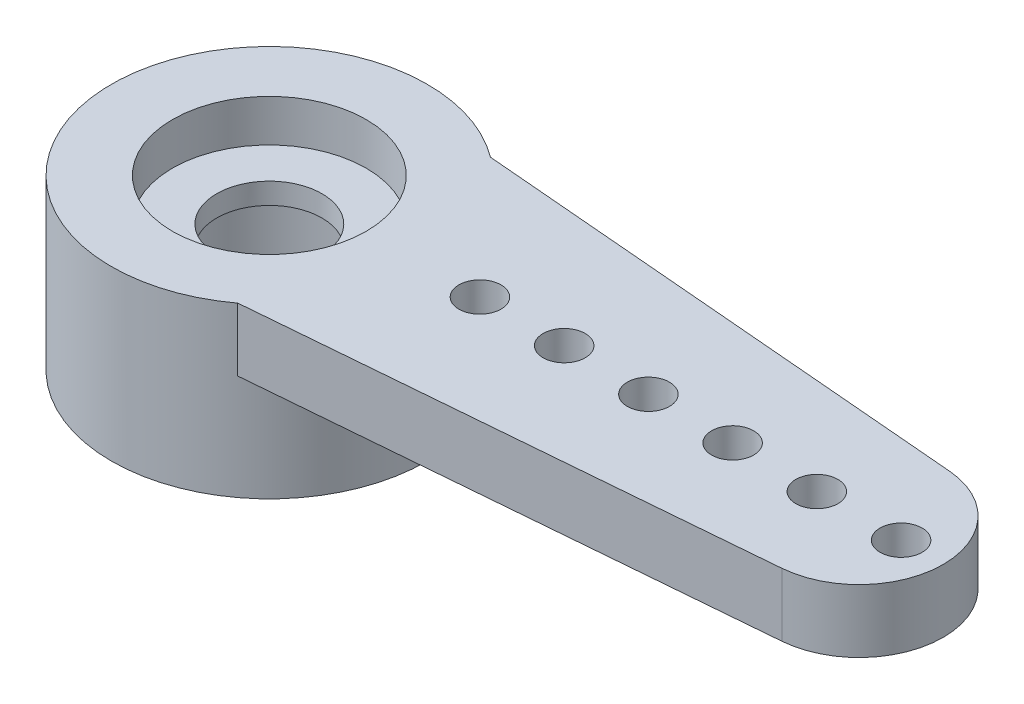
ISO-10303-21;
HEADER;
FILE_DESCRIPTION(('STEP AP214'),'2;1');
FILE_NAME('part.step','',(''),(''),'','','');
FILE_SCHEMA(('AUTOMOTIVE_DESIGN { 1 0 10303 214 1 1 1 1 }'));
ENDSEC;
DATA;
#1=APPLICATION_CONTEXT('core data for automotive mechanical design processes');
#2=APPLICATION_PROTOCOL_DEFINITION('international standard','automotive_design',2000,#1);
#3=PRODUCT_CONTEXT('',#1,'mechanical');
#4=PRODUCT('Part','Part','',(#3));
#5=PRODUCT_RELATED_PRODUCT_CATEGORY('part','',(#4));
#6=PRODUCT_DEFINITION_FORMATION('','',#4);
#7=PRODUCT_DEFINITION_CONTEXT('part definition',#1,'design');
#8=PRODUCT_DEFINITION('design','',#6,#7);
#9=PRODUCT_DEFINITION_SHAPE('','',#8);
#10=(LENGTH_UNIT() NAMED_UNIT(*) SI_UNIT(.MILLI.,.METRE.));
#11=(NAMED_UNIT(*) PLANE_ANGLE_UNIT() SI_UNIT($,.RADIAN.));
#12=(NAMED_UNIT(*) SI_UNIT($,.STERADIAN.) SOLID_ANGLE_UNIT());
#13=UNCERTAINTY_MEASURE_WITH_UNIT(LENGTH_MEASURE(1.E-05),#10,'distance_accuracy_value','');
#14=(GEOMETRIC_REPRESENTATION_CONTEXT(3) GLOBAL_UNCERTAINTY_ASSIGNED_CONTEXT((#13)) GLOBAL_UNIT_ASSIGNED_CONTEXT((#10,
#11,#12)) REPRESENTATION_CONTEXT('',''));
#15=CARTESIAN_POINT('',(0.,0.,0.));
#16=DIRECTION('',(0.,0.,1.));
#17=DIRECTION('',(1.,0.,0.));
#18=AXIS2_PLACEMENT_3D('',#15,#16,#17);
#19=CARTESIAN_POINT('',(0.,-1.5,0.));
#20=DIRECTION('',(0.,1.,0.));
#21=DIRECTION('',(0.,0.,1.));
#22=AXIS2_PLACEMENT_3D('',#19,#20,#21);
#23=CYLINDRICAL_SURFACE('',#22,1.25);
#24=CARTESIAN_POINT('',(0.,3.,0.));
#25=DIRECTION('',(0.,1.,0.));
#26=DIRECTION('',(0.,0.,1.));
#27=AXIS2_PLACEMENT_3D('',#24,#25,#26);
#28=CIRCLE('',#27,1.25);
#29=CARTESIAN_POINT('',(0.,3.,1.25));
#30=VERTEX_POINT('',#29);
#31=EDGE_CURVE('E188',#30,#30,#28,.T.);
#32=ORIENTED_EDGE('',*,*,#31,.T.);
#33=EDGE_LOOP('',(#32));
#34=FACE_BOUND('',#33,.T.);
#35=CARTESIAN_POINT('',(0.,2.5,0.));
#36=DIRECTION('',(0.,-1.,0.));
#37=DIRECTION('',(0.,0.,-1.));
#38=AXIS2_PLACEMENT_3D('',#35,#36,#37);
#39=CIRCLE('',#38,1.25);
#40=CARTESIAN_POINT('',(0.,2.5,-1.25));
#41=VERTEX_POINT('',#40);
#42=EDGE_CURVE('E36',#41,#41,#39,.F.);
#43=ORIENTED_EDGE('',*,*,#42,.F.);
#44=EDGE_LOOP('',(#43));
#45=FACE_BOUND('',#44,.T.);
#46=ADVANCED_FACE('F32',(#34,#45),#23,.F.);
#47=CARTESIAN_POINT('',(0.,4.,0.));
#48=DIRECTION('',(0.,-1.,0.));
#49=DIRECTION('',(0.,0.,-1.));
#50=AXIS2_PLACEMENT_3D('',#47,#48,#49);
#51=CYLINDRICAL_SURFACE('',#50,3.75);
#52=CARTESIAN_POINT('',(0.,4.,0.));
#53=DIRECTION('',(0.,1.,0.));
#54=DIRECTION('',(0.,0.,1.));
#55=AXIS2_PLACEMENT_3D('',#52,#53,#54);
#56=CIRCLE('',#55,3.75);
#57=CARTESIAN_POINT('',(2.25,4.,-3.));
#58=VERTEX_POINT('',#57);
#59=CARTESIAN_POINT('',(2.25,4.,3.));
#60=VERTEX_POINT('',#59);
#61=EDGE_CURVE('E11',#58,#60,#56,.T.);
#62=ORIENTED_EDGE('',*,*,#61,.F.);
#63=DIRECTION('',(0.,1.,0.));
#64=VECTOR('',#63,1.);
#65=CARTESIAN_POINT('',(2.25,2.5,-3.));
#66=LINE('',#65,#64);
#67=CARTESIAN_POINT('',(2.25,2.5,-3.));
#68=VERTEX_POINT('',#67);
#69=EDGE_CURVE('E105',#68,#58,#66,.T.);
#70=ORIENTED_EDGE('',*,*,#69,.F.);
#71=CARTESIAN_POINT('',(0.,2.5,0.));
#72=DIRECTION('',(0.,-1.,0.));
#73=DIRECTION('',(0.,0.,-1.));
#74=AXIS2_PLACEMENT_3D('',#71,#72,#73);
#75=CIRCLE('',#74,3.75);
#76=CARTESIAN_POINT('',(2.25,2.5,3.));
#77=VERTEX_POINT('',#76);
#78=EDGE_CURVE('E57',#68,#77,#75,.T.);
#79=ORIENTED_EDGE('',*,*,#78,.T.);
#80=DIRECTION('',(0.,1.,0.));
#81=VECTOR('',#80,1.);
#82=CARTESIAN_POINT('',(2.25,2.5,3.));
#83=LINE('',#82,#81);
#84=EDGE_CURVE('E81',#77,#60,#83,.T.);
#85=ORIENTED_EDGE('',*,*,#84,.T.);
#86=EDGE_LOOP('',(#62,#70,#79,#85));
#87=FACE_BOUND('',#86,.T.);
#88=CARTESIAN_POINT('',(0.,0.,0.));
#89=DIRECTION('',(0.,1.,0.));
#90=DIRECTION('',(0.,0.,1.));
#91=AXIS2_PLACEMENT_3D('',#88,#89,#90);
#92=CIRCLE('',#91,3.75);
#93=CARTESIAN_POINT('',(0.,0.,3.75));
#94=VERTEX_POINT('',#93);
#95=EDGE_CURVE('E41',#94,#94,#92,.T.);
#96=ORIENTED_EDGE('',*,*,#95,.T.);
#97=EDGE_LOOP('',(#96));
#98=FACE_BOUND('',#97,.T.);
#99=ADVANCED_FACE('F34',(#87,#98),#51,.T.);
#100=CARTESIAN_POINT('',(0.,4.,0.));
#101=DIRECTION('',(0.,1.,0.));
#102=DIRECTION('',(0.,0.,1.));
#103=AXIS2_PLACEMENT_3D('',#100,#101,#102);
#104=PLANE('',#103);
#105=CARTESIAN_POINT('',(0.,4.,0.));
#106=DIRECTION('',(0.,1.,0.));
#107=DIRECTION('',(0.,0.,1.));
#108=AXIS2_PLACEMENT_3D('',#105,#106,#107);
#109=CIRCLE('',#108,2.3);
#110=CARTESIAN_POINT('',(0.,4.,2.3));
#111=VERTEX_POINT('',#110);
#112=EDGE_CURVE('E107',#111,#111,#109,.T.);
#113=ORIENTED_EDGE('',*,*,#112,.F.);
#114=EDGE_LOOP('',(#113));
#115=FACE_BOUND('',#114,.T.);
#116=ORIENTED_EDGE('',*,*,#61,.T.);
#117=DIRECTION('',(0.996448898518601,0.,-0.0841997187707063));
#118=VECTOR('',#117,1.);
#119=CARTESIAN_POINT('',(14.1683994375414,4.,1.9928977970372));
#120=LINE('',#119,#118);
#121=CARTESIAN_POINT('',(14.1683994375414,4.,1.99289779703721));
#122=VERTEX_POINT('',#121);
#123=EDGE_CURVE('E100',#60,#122,#120,.T.);
#124=ORIENTED_EDGE('',*,*,#123,.T.);
#125=CARTESIAN_POINT('',(14.,4.,0.));
#126=DIRECTION('',(0.,1.,0.));
#127=DIRECTION('',(0.,0.,-1.));
#128=AXIS2_PLACEMENT_3D('',#125,#126,#127);
#129=CIRCLE('',#128,2.);
#130=CARTESIAN_POINT('',(14.1683994375414,4.,-1.9928977970372));
#131=VERTEX_POINT('',#130);
#132=EDGE_CURVE('E87',#122,#131,#129,.T.);
#133=ORIENTED_EDGE('',*,*,#132,.T.);
#134=DIRECTION('',(-0.996448898518601,0.,-0.0841997187707069));
#135=VECTOR('',#134,1.);
#136=CARTESIAN_POINT('',(14.1683994375414,4.,-1.9928977970372));
#137=LINE('',#136,#135);
#138=EDGE_CURVE('E48',#131,#58,#137,.T.);
#139=ORIENTED_EDGE('',*,*,#138,.T.);
#140=EDGE_LOOP('',(#116,#124,#133,#139));
#141=FACE_BOUND('',#140,.T.);
#142=CARTESIAN_POINT('',(13.,4.,0.));
#143=DIRECTION('',(0.,1.,0.));
#144=DIRECTION('',(0.,0.,-1.));
#145=AXIS2_PLACEMENT_3D('',#142,#143,#144);
#146=CIRCLE('',#145,0.500000000000001);
#147=CARTESIAN_POINT('',(13.,4.,-0.499999999999997));
#148=VERTEX_POINT('',#147);
#149=EDGE_CURVE('E197',#148,#148,#146,.T.);
#150=ORIENTED_EDGE('',*,*,#149,.F.);
#151=EDGE_LOOP('',(#150));
#152=FACE_BOUND('',#151,.T.);
#153=CARTESIAN_POINT('',(11.,4.,0.));
#154=DIRECTION('',(0.,1.,0.));
#155=DIRECTION('',(0.,0.,-1.));
#156=AXIS2_PLACEMENT_3D('',#153,#154,#155);
#157=CIRCLE('',#156,0.500000000000001);
#158=CARTESIAN_POINT('',(11.,4.,-0.499999999999997));
#159=VERTEX_POINT('',#158);
#160=EDGE_CURVE('E201',#159,#159,#157,.T.);
#161=ORIENTED_EDGE('',*,*,#160,.F.);
#162=EDGE_LOOP('',(#161));
#163=FACE_BOUND('',#162,.T.);
#164=CARTESIAN_POINT('',(9.,4.,0.));
#165=DIRECTION('',(0.,1.,0.));
#166=DIRECTION('',(0.,0.,-1.));
#167=AXIS2_PLACEMENT_3D('',#164,#165,#166);
#168=CIRCLE('',#167,0.500000000000001);
#169=CARTESIAN_POINT('',(9.,4.,-0.499999999999997));
#170=VERTEX_POINT('',#169);
#171=EDGE_CURVE('E205',#170,#170,#168,.T.);
#172=ORIENTED_EDGE('',*,*,#171,.F.);
#173=EDGE_LOOP('',(#172));
#174=FACE_BOUND('',#173,.T.);
#175=CARTESIAN_POINT('',(7.,4.,0.));
#176=DIRECTION('',(0.,1.,0.));
#177=DIRECTION('',(0.,0.,-1.));
#178=AXIS2_PLACEMENT_3D('',#175,#176,#177);
#179=CIRCLE('',#178,0.500000000000001);
#180=CARTESIAN_POINT('',(7.,4.,-0.499999999999997));
#181=VERTEX_POINT('',#180);
#182=EDGE_CURVE('E209',#181,#181,#179,.T.);
#183=ORIENTED_EDGE('',*,*,#182,.F.);
#184=EDGE_LOOP('',(#183));
#185=FACE_BOUND('',#184,.T.);
#186=CARTESIAN_POINT('',(5.,4.,0.));
#187=DIRECTION('',(0.,1.,0.));
#188=DIRECTION('',(0.,0.,-1.));
#189=AXIS2_PLACEMENT_3D('',#186,#187,#188);
#190=CIRCLE('',#189,0.500000000000001);
#191=CARTESIAN_POINT('',(5.,4.,-0.499999999999997));
#192=VERTEX_POINT('',#191);
#193=EDGE_CURVE('E213',#192,#192,#190,.T.);
#194=ORIENTED_EDGE('',*,*,#193,.F.);
#195=EDGE_LOOP('',(#194));
#196=FACE_BOUND('',#195,.T.);
#197=CARTESIAN_POINT('',(15.,4.,0.));
#198=DIRECTION('',(0.,1.,0.));
#199=DIRECTION('',(0.,0.,-1.));
#200=AXIS2_PLACEMENT_3D('',#197,#198,#199);
#201=CIRCLE('',#200,0.500000000000001);
#202=CARTESIAN_POINT('',(15.,4.,-0.499999999999997));
#203=VERTEX_POINT('',#202);
#204=EDGE_CURVE('E216',#203,#203,#201,.T.);
#205=ORIENTED_EDGE('',*,*,#204,.F.);
#206=EDGE_LOOP('',(#205));
#207=FACE_BOUND('',#206,.T.);
#208=ADVANCED_FACE('F121',(#115,#141,#152,#163,#174,#185,#196,#207),#104,.T.);
#209=CARTESIAN_POINT('',(0.,0.,0.));
#210=DIRECTION('',(0.,1.,0.));
#211=DIRECTION('',(0.,0.,1.));
#212=AXIS2_PLACEMENT_3D('',#209,#210,#211);
#213=PLANE('',#212);
#214=CARTESIAN_POINT('',(0.,0.,0.));
#215=DIRECTION('',(0.,-1.,0.));
#216=DIRECTION('',(0.,0.,-1.));
#217=AXIS2_PLACEMENT_3D('',#214,#215,#216);
#218=CIRCLE('',#217,2.3);
#219=CARTESIAN_POINT('',(0.,0.,-2.3));
#220=VERTEX_POINT('',#219);
#221=EDGE_CURVE('E242',#220,#220,#218,.T.);
#222=ORIENTED_EDGE('',*,*,#221,.F.);
#223=EDGE_LOOP('',(#222));
#224=FACE_BOUND('',#223,.T.);
#225=ORIENTED_EDGE('',*,*,#95,.F.);
#226=EDGE_LOOP('',(#225));
#227=FACE_BOUND('',#226,.T.);
#228=ADVANCED_FACE('F118',(#224,#227),#213,.F.);
#229=CARTESIAN_POINT('',(0.,3.,0.));
#230=DIRECTION('',(0.,1.,0.));
#231=DIRECTION('',(0.,0.,1.));
#232=AXIS2_PLACEMENT_3D('',#229,#230,#231);
#233=CYLINDRICAL_SURFACE('',#232,2.3);
#234=CARTESIAN_POINT('',(0.,3.,0.));
#235=DIRECTION('',(0.,1.,0.));
#236=DIRECTION('',(0.,0.,1.));
#237=AXIS2_PLACEMENT_3D('',#234,#235,#236);
#238=CIRCLE('',#237,2.3);
#239=CARTESIAN_POINT('',(0.,3.,2.3));
#240=VERTEX_POINT('',#239);
#241=EDGE_CURVE('E110',#240,#240,#238,.T.);
#242=ORIENTED_EDGE('',*,*,#241,.F.);
#243=EDGE_LOOP('',(#242));
#244=FACE_BOUND('',#243,.T.);
#245=ORIENTED_EDGE('',*,*,#112,.T.);
#246=EDGE_LOOP('',(#245));
#247=FACE_BOUND('',#246,.T.);
#248=ADVANCED_FACE('F120',(#244,#247),#233,.F.);
#249=CARTESIAN_POINT('',(0.,3.,0.));
#250=DIRECTION('',(0.,1.,0.));
#251=DIRECTION('',(0.,0.,1.));
#252=AXIS2_PLACEMENT_3D('',#249,#250,#251);
#253=PLANE('',#252);
#254=ORIENTED_EDGE('',*,*,#31,.F.);
#255=EDGE_LOOP('',(#254));
#256=FACE_BOUND('',#255,.T.);
#257=ORIENTED_EDGE('',*,*,#241,.T.);
#258=EDGE_LOOP('',(#257));
#259=FACE_BOUND('',#258,.T.);
#260=ADVANCED_FACE('F127',(#256,#259),#253,.T.);
#261=CARTESIAN_POINT('',(14.1683994375414,2.5,-1.9928977970372));
#262=DIRECTION('',(0.0841997187707069,0.,-0.996448898518601));
#263=DIRECTION('',(-0.996448898518601,0.,-0.0841997187707069));
#264=AXIS2_PLACEMENT_3D('',#261,#262,#263);
#265=PLANE('',#264);
#266=ORIENTED_EDGE('',*,*,#138,.F.);
#267=DIRECTION('',(0.,1.,0.));
#268=VECTOR('',#267,1.);
#269=CARTESIAN_POINT('',(14.1683994375414,2.5,-1.9928977970372));
#270=LINE('',#269,#268);
#271=CARTESIAN_POINT('',(14.1683994375414,2.5,-1.9928977970372));
#272=VERTEX_POINT('',#271);
#273=EDGE_CURVE('E75',#272,#131,#270,.T.);
#274=ORIENTED_EDGE('',*,*,#273,.F.);
#275=DIRECTION('',(-0.996448898518601,0.,-0.0841997187707069));
#276=VECTOR('',#275,1.);
#277=CARTESIAN_POINT('',(14.1683994375414,2.5,-1.9928977970372));
#278=LINE('',#277,#276);
#279=EDGE_CURVE('E92',#272,#68,#278,.T.);
#280=ORIENTED_EDGE('',*,*,#279,.T.);
#281=ORIENTED_EDGE('',*,*,#69,.T.);
#282=EDGE_LOOP('',(#266,#274,#280,#281));
#283=FACE_BOUND('',#282,.T.);
#284=ADVANCED_FACE('F174',(#283),#265,.T.);
#285=CARTESIAN_POINT('',(14.,2.5,0.));
#286=DIRECTION('',(0.,1.,0.));
#287=DIRECTION('',(0.,0.,1.));
#288=AXIS2_PLACEMENT_3D('',#285,#286,#287);
#289=CYLINDRICAL_SURFACE('',#288,2.);
#290=ORIENTED_EDGE('',*,*,#132,.F.);
#291=DIRECTION('',(0.,1.,0.));
#292=VECTOR('',#291,1.);
#293=CARTESIAN_POINT('',(14.1683994375414,2.5,1.99289779703721));
#294=LINE('',#293,#292);
#295=CARTESIAN_POINT('',(14.1683994375414,2.5,1.99289779703721));
#296=VERTEX_POINT('',#295);
#297=EDGE_CURVE('E83',#296,#122,#294,.T.);
#298=ORIENTED_EDGE('',*,*,#297,.F.);
#299=CARTESIAN_POINT('',(14.,2.5,0.));
#300=DIRECTION('',(0.,1.,0.));
#301=DIRECTION('',(0.,0.,-1.));
#302=AXIS2_PLACEMENT_3D('',#299,#300,#301);
#303=CIRCLE('',#302,2.);
#304=EDGE_CURVE('E86',#296,#272,#303,.T.);
#305=ORIENTED_EDGE('',*,*,#304,.T.);
#306=ORIENTED_EDGE('',*,*,#273,.T.);
#307=EDGE_LOOP('',(#290,#298,#305,#306));
#308=FACE_BOUND('',#307,.T.);
#309=ADVANCED_FACE('F85',(#308),#289,.T.);
#310=CARTESIAN_POINT('',(14.1683994375414,2.5,1.9928977970372));
#311=DIRECTION('',(0.0841997187707063,0.,0.996448898518601));
#312=DIRECTION('',(0.996448898518601,0.,-0.0841997187707063));
#313=AXIS2_PLACEMENT_3D('',#310,#311,#312);
#314=PLANE('',#313);
#315=ORIENTED_EDGE('',*,*,#123,.F.);
#316=ORIENTED_EDGE('',*,*,#84,.F.);
#317=DIRECTION('',(0.996448898518601,0.,-0.0841997187707063));
#318=VECTOR('',#317,1.);
#319=CARTESIAN_POINT('',(14.1683994375414,2.5,1.9928977970372));
#320=LINE('',#319,#318);
#321=EDGE_CURVE('E91',#77,#296,#320,.T.);
#322=ORIENTED_EDGE('',*,*,#321,.T.);
#323=ORIENTED_EDGE('',*,*,#297,.T.);
#324=EDGE_LOOP('',(#315,#316,#322,#323));
#325=FACE_BOUND('',#324,.T.);
#326=ADVANCED_FACE('F94',(#325),#314,.T.);
#327=CARTESIAN_POINT('',(0.,2.5,0.));
#328=DIRECTION('',(0.,-1.,0.));
#329=DIRECTION('',(0.,0.,-1.));
#330=AXIS2_PLACEMENT_3D('',#327,#328,#329);
#331=PLANE('',#330);
#332=CARTESIAN_POINT('',(13.,2.5,0.));
#333=DIRECTION('',(0.,1.,0.));
#334=DIRECTION('',(0.,0.,-1.));
#335=AXIS2_PLACEMENT_3D('',#332,#333,#334);
#336=CIRCLE('',#335,0.500000000000001);
#337=CARTESIAN_POINT('',(13.,2.5,-0.499999999999997));
#338=VERTEX_POINT('',#337);
#339=EDGE_CURVE('E235',#338,#338,#336,.T.);
#340=ORIENTED_EDGE('',*,*,#339,.T.);
#341=EDGE_LOOP('',(#340));
#342=FACE_BOUND('',#341,.T.);
#343=CARTESIAN_POINT('',(11.,2.5,0.));
#344=DIRECTION('',(0.,1.,0.));
#345=DIRECTION('',(0.,0.,-1.));
#346=AXIS2_PLACEMENT_3D('',#343,#344,#345);
#347=CIRCLE('',#346,0.500000000000001);
#348=CARTESIAN_POINT('',(11.,2.5,-0.499999999999997));
#349=VERTEX_POINT('',#348);
#350=EDGE_CURVE('E231',#349,#349,#347,.T.);
#351=ORIENTED_EDGE('',*,*,#350,.T.);
#352=EDGE_LOOP('',(#351));
#353=FACE_BOUND('',#352,.T.);
#354=CARTESIAN_POINT('',(9.,2.5,0.));
#355=DIRECTION('',(0.,1.,0.));
#356=DIRECTION('',(0.,0.,-1.));
#357=AXIS2_PLACEMENT_3D('',#354,#355,#356);
#358=CIRCLE('',#357,0.500000000000001);
#359=CARTESIAN_POINT('',(9.,2.5,-0.499999999999997));
#360=VERTEX_POINT('',#359);
#361=EDGE_CURVE('E227',#360,#360,#358,.T.);
#362=ORIENTED_EDGE('',*,*,#361,.T.);
#363=EDGE_LOOP('',(#362));
#364=FACE_BOUND('',#363,.T.);
#365=CARTESIAN_POINT('',(7.,2.5,0.));
#366=DIRECTION('',(0.,1.,0.));
#367=DIRECTION('',(0.,0.,-1.));
#368=AXIS2_PLACEMENT_3D('',#365,#366,#367);
#369=CIRCLE('',#368,0.500000000000001);
#370=CARTESIAN_POINT('',(7.,2.5,-0.499999999999997));
#371=VERTEX_POINT('',#370);
#372=EDGE_CURVE('E224',#371,#371,#369,.T.);
#373=ORIENTED_EDGE('',*,*,#372,.T.);
#374=EDGE_LOOP('',(#373));
#375=FACE_BOUND('',#374,.T.);
#376=CARTESIAN_POINT('',(5.,2.5,0.));
#377=DIRECTION('',(0.,1.,0.));
#378=DIRECTION('',(0.,0.,-1.));
#379=AXIS2_PLACEMENT_3D('',#376,#377,#378);
#380=CIRCLE('',#379,0.500000000000001);
#381=CARTESIAN_POINT('',(5.,2.5,-0.499999999999997));
#382=VERTEX_POINT('',#381);
#383=EDGE_CURVE('E218',#382,#382,#380,.T.);
#384=ORIENTED_EDGE('',*,*,#383,.T.);
#385=EDGE_LOOP('',(#384));
#386=FACE_BOUND('',#385,.T.);
#387=CARTESIAN_POINT('',(15.,2.5,0.));
#388=DIRECTION('',(0.,1.,0.));
#389=DIRECTION('',(0.,0.,-1.));
#390=AXIS2_PLACEMENT_3D('',#387,#388,#389);
#391=CIRCLE('',#390,0.500000000000001);
#392=CARTESIAN_POINT('',(15.,2.5,-0.499999999999997));
#393=VERTEX_POINT('',#392);
#394=EDGE_CURVE('E102',#393,#393,#391,.T.);
#395=ORIENTED_EDGE('',*,*,#394,.T.);
#396=EDGE_LOOP('',(#395));
#397=FACE_BOUND('',#396,.T.);
#398=ORIENTED_EDGE('',*,*,#78,.F.);
#399=ORIENTED_EDGE('',*,*,#279,.F.);
#400=ORIENTED_EDGE('',*,*,#304,.F.);
#401=ORIENTED_EDGE('',*,*,#321,.F.);
#402=EDGE_LOOP('',(#398,#399,#400,#401));
#403=FACE_BOUND('',#402,.T.);
#404=ADVANCED_FACE('F90',(#342,#353,#364,#375,#386,#397,#403),#331,.T.);
#405=CARTESIAN_POINT('',(15.,2.5,0.));
#406=DIRECTION('',(0.,1.,0.));
#407=DIRECTION('',(0.,0.,1.));
#408=AXIS2_PLACEMENT_3D('',#405,#406,#407);
#409=CYLINDRICAL_SURFACE('',#408,0.500000000000001);
#410=ORIENTED_EDGE('',*,*,#394,.F.);
#411=EDGE_LOOP('',(#410));
#412=FACE_BOUND('',#411,.T.);
#413=ORIENTED_EDGE('',*,*,#204,.T.);
#414=EDGE_LOOP('',(#413));
#415=FACE_BOUND('',#414,.T.);
#416=ADVANCED_FACE('F166',(#412,#415),#409,.F.);
#417=CARTESIAN_POINT('',(5.,2.5,0.));
#418=DIRECTION('',(0.,1.,0.));
#419=DIRECTION('',(0.,0.,1.));
#420=AXIS2_PLACEMENT_3D('',#417,#418,#419);
#421=CYLINDRICAL_SURFACE('',#420,0.500000000000001);
#422=ORIENTED_EDGE('',*,*,#383,.F.);
#423=EDGE_LOOP('',(#422));
#424=FACE_BOUND('',#423,.T.);
#425=ORIENTED_EDGE('',*,*,#193,.T.);
#426=EDGE_LOOP('',(#425));
#427=FACE_BOUND('',#426,.T.);
#428=ADVANCED_FACE('F162',(#424,#427),#421,.F.);
#429=CARTESIAN_POINT('',(7.,2.5,0.));
#430=DIRECTION('',(0.,1.,0.));
#431=DIRECTION('',(0.,0.,1.));
#432=AXIS2_PLACEMENT_3D('',#429,#430,#431);
#433=CYLINDRICAL_SURFACE('',#432,0.500000000000001);
#434=ORIENTED_EDGE('',*,*,#372,.F.);
#435=EDGE_LOOP('',(#434));
#436=FACE_BOUND('',#435,.T.);
#437=ORIENTED_EDGE('',*,*,#182,.T.);
#438=EDGE_LOOP('',(#437));
#439=FACE_BOUND('',#438,.T.);
#440=ADVANCED_FACE('F158',(#436,#439),#433,.F.);
#441=CARTESIAN_POINT('',(9.,2.5,0.));
#442=DIRECTION('',(0.,1.,0.));
#443=DIRECTION('',(0.,0.,1.));
#444=AXIS2_PLACEMENT_3D('',#441,#442,#443);
#445=CYLINDRICAL_SURFACE('',#444,0.500000000000001);
#446=ORIENTED_EDGE('',*,*,#361,.F.);
#447=EDGE_LOOP('',(#446));
#448=FACE_BOUND('',#447,.T.);
#449=ORIENTED_EDGE('',*,*,#171,.T.);
#450=EDGE_LOOP('',(#449));
#451=FACE_BOUND('',#450,.T.);
#452=ADVANCED_FACE('F154',(#448,#451),#445,.F.);
#453=CARTESIAN_POINT('',(11.,2.5,0.));
#454=DIRECTION('',(0.,1.,0.));
#455=DIRECTION('',(0.,0.,1.));
#456=AXIS2_PLACEMENT_3D('',#453,#454,#455);
#457=CYLINDRICAL_SURFACE('',#456,0.500000000000001);
#458=ORIENTED_EDGE('',*,*,#350,.F.);
#459=EDGE_LOOP('',(#458));
#460=FACE_BOUND('',#459,.T.);
#461=ORIENTED_EDGE('',*,*,#160,.T.);
#462=EDGE_LOOP('',(#461));
#463=FACE_BOUND('',#462,.T.);
#464=ADVANCED_FACE('F150',(#460,#463),#457,.F.);
#465=CARTESIAN_POINT('',(13.,2.5,0.));
#466=DIRECTION('',(0.,1.,0.));
#467=DIRECTION('',(0.,0.,1.));
#468=AXIS2_PLACEMENT_3D('',#465,#466,#467);
#469=CYLINDRICAL_SURFACE('',#468,0.500000000000001);
#470=ORIENTED_EDGE('',*,*,#339,.F.);
#471=EDGE_LOOP('',(#470));
#472=FACE_BOUND('',#471,.T.);
#473=ORIENTED_EDGE('',*,*,#149,.T.);
#474=EDGE_LOOP('',(#473));
#475=FACE_BOUND('',#474,.T.);
#476=ADVANCED_FACE('F146',(#472,#475),#469,.F.);
#477=CARTESIAN_POINT('',(0.,2.5,0.));
#478=DIRECTION('',(0.,-1.,0.));
#479=DIRECTION('',(0.,0.,-1.));
#480=AXIS2_PLACEMENT_3D('',#477,#478,#479);
#481=PLANE('',#480);
#482=CARTESIAN_POINT('',(0.,2.5,0.));
#483=DIRECTION('',(0.,-1.,0.));
#484=DIRECTION('',(0.,0.,-1.));
#485=AXIS2_PLACEMENT_3D('',#482,#483,#484);
#486=CIRCLE('',#485,2.3);
#487=CARTESIAN_POINT('',(0.,2.5,-2.3));
#488=VERTEX_POINT('',#487);
#489=EDGE_CURVE('E245',#488,#488,#486,.T.);
#490=ORIENTED_EDGE('',*,*,#489,.T.);
#491=EDGE_LOOP('',(#490));
#492=FACE_BOUND('',#491,.T.);
#493=ORIENTED_EDGE('',*,*,#42,.T.);
#494=EDGE_LOOP('',(#493));
#495=FACE_BOUND('',#494,.T.);
#496=ADVANCED_FACE('F149',(#492,#495),#481,.T.);
#497=CARTESIAN_POINT('',(0.,2.5,0.));
#498=DIRECTION('',(0.,-1.,0.));
#499=DIRECTION('',(0.,0.,-1.));
#500=AXIS2_PLACEMENT_3D('',#497,#498,#499);
#501=CYLINDRICAL_SURFACE('',#500,2.3);
#502=ORIENTED_EDGE('',*,*,#489,.F.);
#503=EDGE_LOOP('',(#502));
#504=FACE_BOUND('',#503,.T.);
#505=ORIENTED_EDGE('',*,*,#221,.T.);
#506=EDGE_LOOP('',(#505));
#507=FACE_BOUND('',#506,.T.);
#508=ADVANCED_FACE('F144',(#504,#507),#501,.F.);
#509=CLOSED_SHELL('',(#46,#99,#208,#228,#248,#260,#284,#309,#326,#404,#416,#428,#440,#452,#464,
#476,#496,#508));
#510=MANIFOLD_SOLID_BREP('B2',#509);
#511=ADVANCED_BREP_SHAPE_REPRESENTATION('',(#18,#510),#14);
#512=SHAPE_DEFINITION_REPRESENTATION(#9,#511);
ENDSEC;
END-ISO-10303-21;
